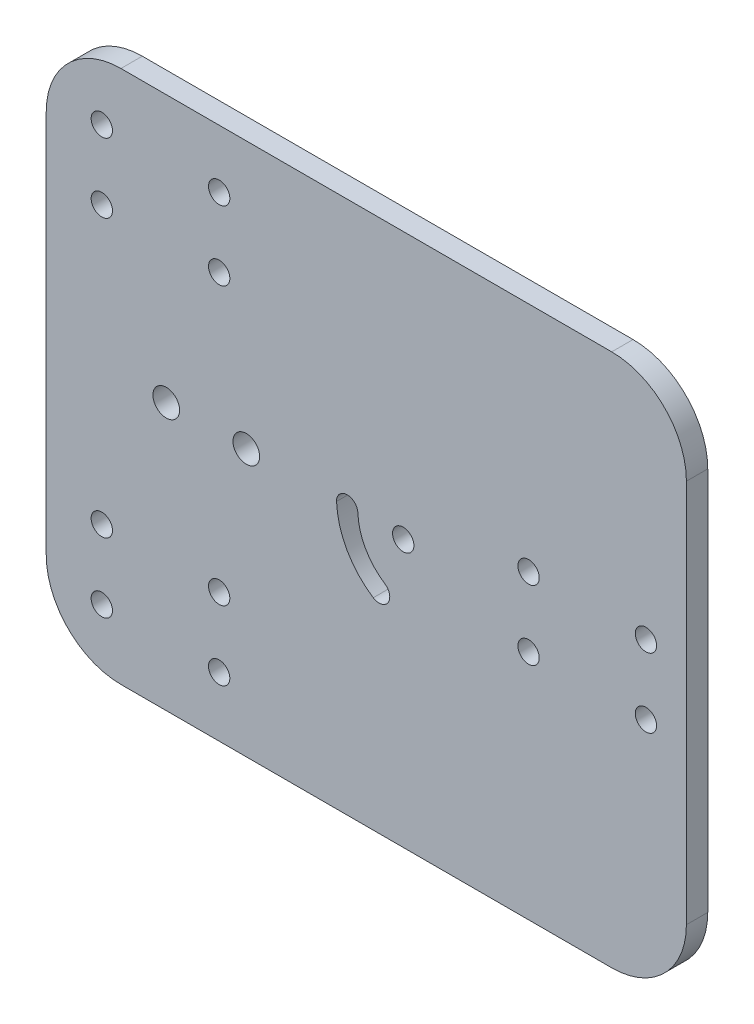
ISO-10303-21;
HEADER;
FILE_DESCRIPTION(('STEP AP214'),'2;1');
FILE_NAME('part.step','',(''),(''),'','','');
FILE_SCHEMA(('AUTOMOTIVE_DESIGN { 1 0 10303 214 1 1 1 1 }'));
ENDSEC;
DATA;
#1=APPLICATION_CONTEXT('core data for automotive mechanical design processes');
#2=APPLICATION_PROTOCOL_DEFINITION('international standard','automotive_design',2000,#1);
#3=PRODUCT_CONTEXT('',#1,'mechanical');
#4=PRODUCT('Part','Part','',(#3));
#5=PRODUCT_RELATED_PRODUCT_CATEGORY('part','',(#4));
#6=PRODUCT_DEFINITION_FORMATION('','',#4);
#7=PRODUCT_DEFINITION_CONTEXT('part definition',#1,'design');
#8=PRODUCT_DEFINITION('design','',#6,#7);
#9=PRODUCT_DEFINITION_SHAPE('','',#8);
#10=(LENGTH_UNIT() NAMED_UNIT(*) SI_UNIT(.MILLI.,.METRE.));
#11=(NAMED_UNIT(*) PLANE_ANGLE_UNIT() SI_UNIT($,.RADIAN.));
#12=(NAMED_UNIT(*) SI_UNIT($,.STERADIAN.) SOLID_ANGLE_UNIT());
#13=UNCERTAINTY_MEASURE_WITH_UNIT(LENGTH_MEASURE(1.E-05),#10,'distance_accuracy_value','');
#14=(GEOMETRIC_REPRESENTATION_CONTEXT(3) GLOBAL_UNCERTAINTY_ASSIGNED_CONTEXT((#13)) GLOBAL_UNIT_ASSIGNED_CONTEXT((#10,
#11,#12)) REPRESENTATION_CONTEXT('',''));
#15=CARTESIAN_POINT('',(0.,0.,0.));
#16=DIRECTION('',(0.,0.,1.));
#17=DIRECTION('',(1.,0.,0.));
#18=AXIS2_PLACEMENT_3D('',#15,#16,#17);
#19=CARTESIAN_POINT('',(-52.655601659751,38.8381742738589,4.));
#20=DIRECTION('',(1.,0.,0.));
#21=DIRECTION('',(0.,1.,0.));
#22=AXIS2_PLACEMENT_3D('',#19,#20,#21);
#23=PLANE('',#22);
#24=DIRECTION('',(0.,-1.,0.));
#25=VECTOR('',#24,1.);
#26=CARTESIAN_POINT('',(-52.655601659751,38.8381742738589,0.));
#27=LINE('',#26,#25);
#28=CARTESIAN_POINT('',(-52.655601659751,24.8381742738589,0.));
#29=VERTEX_POINT('',#28);
#30=CARTESIAN_POINT('',(-52.655601659751,-47.1618257261411,0.));
#31=VERTEX_POINT('',#30);
#32=EDGE_CURVE('E189',#29,#31,#27,.T.);
#33=ORIENTED_EDGE('',*,*,#32,.T.);
#34=DIRECTION('',(0.,0.,-1.));
#35=VECTOR('',#34,1.);
#36=CARTESIAN_POINT('',(-52.655601659751,-47.1618257261411,4.));
#37=LINE('',#36,#35);
#38=CARTESIAN_POINT('',(-52.655601659751,-47.1618257261411,4.));
#39=VERTEX_POINT('',#38);
#40=EDGE_CURVE('E11',#31,#39,#37,.F.);
#41=ORIENTED_EDGE('',*,*,#40,.T.);
#42=DIRECTION('',(0.,-1.,0.));
#43=VECTOR('',#42,1.);
#44=CARTESIAN_POINT('',(-52.655601659751,38.8381742738589,4.));
#45=LINE('',#44,#43);
#46=CARTESIAN_POINT('',(-52.655601659751,24.8381742738589,4.));
#47=VERTEX_POINT('',#46);
#48=EDGE_CURVE('E201',#47,#39,#45,.T.);
#49=ORIENTED_EDGE('',*,*,#48,.F.);
#50=DIRECTION('',(0.,0.,-1.));
#51=VECTOR('',#50,1.);
#52=CARTESIAN_POINT('',(-52.655601659751,24.8381742738589,4.));
#53=LINE('',#52,#51);
#54=EDGE_CURVE('E52',#47,#29,#53,.T.);
#55=ORIENTED_EDGE('',*,*,#54,.T.);
#56=EDGE_LOOP('',(#33,#41,#49,#55));
#57=FACE_BOUND('',#56,.T.);
#58=ADVANCED_FACE('F43',(#57),#23,.F.);
#59=CARTESIAN_POINT('',(-52.655601659751,-61.1618257261411,4.));
#60=DIRECTION('',(0.,1.,0.));
#61=DIRECTION('',(0.,0.,1.));
#62=AXIS2_PLACEMENT_3D('',#59,#60,#61);
#63=PLANE('',#62);
#64=DIRECTION('',(1.,0.,0.));
#65=VECTOR('',#64,1.);
#66=CARTESIAN_POINT('',(-52.655601659751,-61.1618257261411,0.));
#67=LINE('',#66,#65);
#68=CARTESIAN_POINT('',(-38.655601659751,-61.1618257261411,0.));
#69=VERTEX_POINT('',#68);
#70=CARTESIAN_POINT('',(53.3443983402489,-61.1618257261411,0.));
#71=VERTEX_POINT('',#70);
#72=EDGE_CURVE('E222',#69,#71,#67,.T.);
#73=ORIENTED_EDGE('',*,*,#72,.T.);
#74=DIRECTION('',(0.,0.,-1.));
#75=VECTOR('',#74,1.);
#76=CARTESIAN_POINT('',(53.344398340249,-61.1618257261411,4.));
#77=LINE('',#76,#75);
#78=CARTESIAN_POINT('',(53.3443983402489,-61.1618257261411,4.));
#79=VERTEX_POINT('',#78);
#80=EDGE_CURVE('E274',#71,#79,#77,.F.);
#81=ORIENTED_EDGE('',*,*,#80,.T.);
#82=DIRECTION('',(1.,0.,0.));
#83=VECTOR('',#82,1.);
#84=CARTESIAN_POINT('',(-52.655601659751,-61.1618257261411,4.));
#85=LINE('',#84,#83);
#86=CARTESIAN_POINT('',(-38.655601659751,-61.1618257261411,4.));
#87=VERTEX_POINT('',#86);
#88=EDGE_CURVE('E205',#87,#79,#85,.T.);
#89=ORIENTED_EDGE('',*,*,#88,.F.);
#90=DIRECTION('',(0.,0.,-1.));
#91=VECTOR('',#90,1.);
#92=CARTESIAN_POINT('',(-38.655601659751,-61.1618257261411,4.));
#93=LINE('',#92,#91);
#94=EDGE_CURVE('E270',#87,#69,#93,.T.);
#95=ORIENTED_EDGE('',*,*,#94,.T.);
#96=EDGE_LOOP('',(#73,#81,#89,#95));
#97=FACE_BOUND('',#96,.T.);
#98=ADVANCED_FACE('F295',(#97),#63,.F.);
#99=CARTESIAN_POINT('',(67.344398340249,38.8381742738589,4.));
#100=DIRECTION('',(-1.,0.,0.));
#101=DIRECTION('',(0.,0.,1.));
#102=AXIS2_PLACEMENT_3D('',#99,#100,#101);
#103=PLANE('',#102);
#104=DIRECTION('',(0.,1.,0.));
#105=VECTOR('',#104,1.);
#106=CARTESIAN_POINT('',(67.344398340249,38.8381742738589,0.));
#107=LINE('',#106,#105);
#108=CARTESIAN_POINT('',(67.344398340249,-47.1618257261411,0.));
#109=VERTEX_POINT('',#108);
#110=CARTESIAN_POINT('',(67.344398340249,24.8381742738589,0.));
#111=VERTEX_POINT('',#110);
#112=EDGE_CURVE('E226',#109,#111,#107,.T.);
#113=ORIENTED_EDGE('',*,*,#112,.T.);
#114=DIRECTION('',(0.,0.,-1.));
#115=VECTOR('',#114,1.);
#116=CARTESIAN_POINT('',(67.344398340249,24.8381742738589,4.));
#117=LINE('',#116,#115);
#118=CARTESIAN_POINT('',(67.344398340249,24.8381742738589,4.));
#119=VERTEX_POINT('',#118);
#120=EDGE_CURVE('E255',#111,#119,#117,.F.);
#121=ORIENTED_EDGE('',*,*,#120,.T.);
#122=DIRECTION('',(0.,1.,0.));
#123=VECTOR('',#122,1.);
#124=CARTESIAN_POINT('',(67.344398340249,38.8381742738589,4.));
#125=LINE('',#124,#123);
#126=CARTESIAN_POINT('',(67.344398340249,-47.1618257261411,4.));
#127=VERTEX_POINT('',#126);
#128=EDGE_CURVE('E210',#127,#119,#125,.T.);
#129=ORIENTED_EDGE('',*,*,#128,.F.);
#130=DIRECTION('',(0.,0.,-1.));
#131=VECTOR('',#130,1.);
#132=CARTESIAN_POINT('',(67.344398340249,-47.1618257261411,4.));
#133=LINE('',#132,#131);
#134=EDGE_CURVE('E251',#127,#109,#133,.T.);
#135=ORIENTED_EDGE('',*,*,#134,.T.);
#136=EDGE_LOOP('',(#113,#121,#129,#135));
#137=FACE_BOUND('',#136,.T.);
#138=ADVANCED_FACE('F305',(#137),#103,.F.);
#139=CARTESIAN_POINT('',(-52.655601659751,38.8381742738589,4.));
#140=DIRECTION('',(0.,-1.,0.));
#141=DIRECTION('',(0.,0.,-1.));
#142=AXIS2_PLACEMENT_3D('',#139,#140,#141);
#143=PLANE('',#142);
#144=DIRECTION('',(-1.,0.,0.));
#145=VECTOR('',#144,1.);
#146=CARTESIAN_POINT('',(-52.655601659751,38.8381742738589,4.));
#147=LINE('',#146,#145);
#148=CARTESIAN_POINT('',(53.344398340249,38.8381742738589,4.));
#149=VERTEX_POINT('',#148);
#150=CARTESIAN_POINT('',(-38.655601659751,38.8381742738589,4.));
#151=VERTEX_POINT('',#150);
#152=EDGE_CURVE('E214',#149,#151,#147,.T.);
#153=ORIENTED_EDGE('',*,*,#152,.F.);
#154=DIRECTION('',(0.,0.,-1.));
#155=VECTOR('',#154,1.);
#156=CARTESIAN_POINT('',(53.344398340249,38.8381742738589,4.));
#157=LINE('',#156,#155);
#158=CARTESIAN_POINT('',(53.344398340249,38.8381742738589,0.));
#159=VERTEX_POINT('',#158);
#160=EDGE_CURVE('E235',#149,#159,#157,.T.);
#161=ORIENTED_EDGE('',*,*,#160,.T.);
#162=DIRECTION('',(-1.,0.,0.));
#163=VECTOR('',#162,1.);
#164=CARTESIAN_POINT('',(-52.655601659751,38.8381742738589,0.));
#165=LINE('',#164,#163);
#166=CARTESIAN_POINT('',(-38.655601659751,38.8381742738589,0.));
#167=VERTEX_POINT('',#166);
#168=EDGE_CURVE('E206',#159,#167,#165,.T.);
#169=ORIENTED_EDGE('',*,*,#168,.T.);
#170=DIRECTION('',(0.,0.,-1.));
#171=VECTOR('',#170,1.);
#172=CARTESIAN_POINT('',(-38.655601659751,38.8381742738589,4.));
#173=LINE('',#172,#171);
#174=EDGE_CURVE('E218',#167,#151,#173,.F.);
#175=ORIENTED_EDGE('',*,*,#174,.T.);
#176=EDGE_LOOP('',(#153,#161,#169,#175));
#177=FACE_BOUND('',#176,.T.);
#178=ADVANCED_FACE('F313',(#177),#143,.F.);
#179=CARTESIAN_POINT('',(0.,0.,4.));
#180=DIRECTION('',(0.,0.,1.));
#181=DIRECTION('',(1.,0.,0.));
#182=AXIS2_PLACEMENT_3D('',#179,#180,#181);
#183=PLANE('',#182);
#184=CARTESIAN_POINT('',(14.2590681390147,-11.1618257261411,4.));
#185=DIRECTION('',(0.,0.,-1.));
#186=DIRECTION('',(-1.,0.,0.));
#187=AXIS2_PLACEMENT_3D('',#184,#185,#186);
#188=CIRCLE('',#187,2.);
#189=CARTESIAN_POINT('',(12.2590681390147,-11.1618257261411,4.));
#190=VERTEX_POINT('',#189);
#191=EDGE_CURVE('E641',#190,#190,#188,.T.);
#192=ORIENTED_EDGE('',*,*,#191,.T.);
#193=EDGE_LOOP('',(#192));
#194=FACE_BOUND('',#193,.T.);
#195=CARTESIAN_POINT('',(37.7590681390147,-17.6618257261411,4.));
#196=DIRECTION('',(0.,0.,-1.));
#197=DIRECTION('',(-1.,0.,0.));
#198=AXIS2_PLACEMENT_3D('',#195,#196,#197);
#199=CIRCLE('',#198,2.);
#200=CARTESIAN_POINT('',(35.7590681390147,-17.6618257261411,4.));
#201=VERTEX_POINT('',#200);
#202=EDGE_CURVE('E662',#201,#201,#199,.T.);
#203=ORIENTED_EDGE('',*,*,#202,.T.);
#204=EDGE_LOOP('',(#203));
#205=FACE_BOUND('',#204,.T.);
#206=CARTESIAN_POINT('',(59.7590681390147,-17.6618257261411,4.));
#207=DIRECTION('',(0.,0.,-1.));
#208=DIRECTION('',(-1.,0.,0.));
#209=AXIS2_PLACEMENT_3D('',#206,#207,#208);
#210=CIRCLE('',#209,2.00000000000001);
#211=CARTESIAN_POINT('',(57.7590681390147,-17.6618257261411,4.));
#212=VERTEX_POINT('',#211);
#213=EDGE_CURVE('E670',#212,#212,#210,.T.);
#214=ORIENTED_EDGE('',*,*,#213,.T.);
#215=EDGE_LOOP('',(#214));
#216=FACE_BOUND('',#215,.T.);
#217=CARTESIAN_POINT('',(59.7590681390147,-4.66182572614111,4.));
#218=DIRECTION('',(0.,0.,-1.));
#219=DIRECTION('',(-1.,0.,0.));
#220=AXIS2_PLACEMENT_3D('',#217,#218,#219);
#221=CIRCLE('',#220,2.);
#222=CARTESIAN_POINT('',(57.7590681390147,-4.66182572614111,4.));
#223=VERTEX_POINT('',#222);
#224=EDGE_CURVE('E160',#223,#223,#221,.T.);
#225=ORIENTED_EDGE('',*,*,#224,.T.);
#226=EDGE_LOOP('',(#225));
#227=FACE_BOUND('',#226,.T.);
#228=CARTESIAN_POINT('',(37.7590681390147,-4.6618257261411,4.));
#229=DIRECTION('',(0.,0.,-1.));
#230=DIRECTION('',(-1.,0.,0.));
#231=AXIS2_PLACEMENT_3D('',#228,#229,#230);
#232=CIRCLE('',#231,2.);
#233=CARTESIAN_POINT('',(35.7590681390147,-4.6618257261411,4.));
#234=VERTEX_POINT('',#233);
#235=EDGE_CURVE('E656',#234,#234,#232,.T.);
#236=ORIENTED_EDGE('',*,*,#235,.T.);
#237=EDGE_LOOP('',(#236));
#238=FACE_BOUND('',#237,.T.);
#239=CARTESIAN_POINT('',(-20.2409318609853,27.942072999651,4.));
#240=DIRECTION('',(0.,0.,-1.));
#241=DIRECTION('',(-1.,0.,0.));
#242=AXIS2_PLACEMENT_3D('',#239,#240,#241);
#243=CIRCLE('',#242,2.);
#244=CARTESIAN_POINT('',(-22.2409318609853,27.942072999651,4.));
#245=VERTEX_POINT('',#244);
#246=EDGE_CURVE('E646',#245,#245,#243,.T.);
#247=ORIENTED_EDGE('',*,*,#246,.T.);
#248=EDGE_LOOP('',(#247));
#249=FACE_BOUND('',#248,.T.);
#250=CARTESIAN_POINT('',(-20.2409318609853,14.942072999651,4.));
#251=DIRECTION('',(0.,0.,-1.));
#252=DIRECTION('',(-1.,0.,0.));
#253=AXIS2_PLACEMENT_3D('',#250,#251,#252);
#254=CIRCLE('',#253,2.);
#255=CARTESIAN_POINT('',(-22.2409318609853,14.942072999651,4.));
#256=VERTEX_POINT('',#255);
#257=EDGE_CURVE('E693',#256,#256,#254,.T.);
#258=ORIENTED_EDGE('',*,*,#257,.T.);
#259=EDGE_LOOP('',(#258));
#260=FACE_BOUND('',#259,.T.);
#261=CARTESIAN_POINT('',(-42.2409318609853,27.9420729996511,4.));
#262=DIRECTION('',(0.,0.,-1.));
#263=DIRECTION('',(-1.,0.,0.));
#264=AXIS2_PLACEMENT_3D('',#261,#262,#263);
#265=CIRCLE('',#264,2.);
#266=CARTESIAN_POINT('',(-44.2409318609853,27.9420729996511,4.));
#267=VERTEX_POINT('',#266);
#268=EDGE_CURVE('E701',#267,#267,#265,.T.);
#269=ORIENTED_EDGE('',*,*,#268,.T.);
#270=EDGE_LOOP('',(#269));
#271=FACE_BOUND('',#270,.T.);
#272=CARTESIAN_POINT('',(-42.2409318609853,14.942072999651,4.));
#273=DIRECTION('',(0.,0.,-1.));
#274=DIRECTION('',(-1.,0.,0.));
#275=AXIS2_PLACEMENT_3D('',#272,#273,#274);
#276=CIRCLE('',#275,2.);
#277=CARTESIAN_POINT('',(-44.2409318609853,14.942072999651,4.));
#278=VERTEX_POINT('',#277);
#279=EDGE_CURVE('E709',#278,#278,#276,.T.);
#280=ORIENTED_EDGE('',*,*,#279,.T.);
#281=EDGE_LOOP('',(#280));
#282=FACE_BOUND('',#281,.T.);
#283=CARTESIAN_POINT('',(-20.2409318609853,-36.9652683243143,4.));
#284=DIRECTION('',(0.,0.,-1.));
#285=DIRECTION('',(-1.,0.,0.));
#286=AXIS2_PLACEMENT_3D('',#283,#284,#285);
#287=CIRCLE('',#286,2.);
#288=CARTESIAN_POINT('',(-22.2409318609853,-36.9652683243143,4.));
#289=VERTEX_POINT('',#288);
#290=EDGE_CURVE('E717',#289,#289,#287,.T.);
#291=ORIENTED_EDGE('',*,*,#290,.T.);
#292=EDGE_LOOP('',(#291));
#293=FACE_BOUND('',#292,.T.);
#294=CARTESIAN_POINT('',(-42.2409318609853,-36.9652683243143,4.));
#295=DIRECTION('',(0.,0.,-1.));
#296=DIRECTION('',(-1.,0.,0.));
#297=AXIS2_PLACEMENT_3D('',#294,#295,#296);
#298=CIRCLE('',#297,2.);
#299=CARTESIAN_POINT('',(-44.2409318609853,-36.9652683243143,4.));
#300=VERTEX_POINT('',#299);
#301=EDGE_CURVE('E725',#300,#300,#298,.T.);
#302=ORIENTED_EDGE('',*,*,#301,.T.);
#303=EDGE_LOOP('',(#302));
#304=FACE_BOUND('',#303,.T.);
#305=CARTESIAN_POINT('',(-20.2409318609853,-49.9652683243143,4.));
#306=DIRECTION('',(0.,0.,-1.));
#307=DIRECTION('',(-1.,0.,0.));
#308=AXIS2_PLACEMENT_3D('',#305,#306,#307);
#309=CIRCLE('',#308,2.);
#310=CARTESIAN_POINT('',(-22.2409318609853,-49.9652683243143,4.));
#311=VERTEX_POINT('',#310);
#312=EDGE_CURVE('E733',#311,#311,#309,.T.);
#313=ORIENTED_EDGE('',*,*,#312,.T.);
#314=EDGE_LOOP('',(#313));
#315=FACE_BOUND('',#314,.T.);
#316=CARTESIAN_POINT('',(-42.2409318609853,-49.9652683243143,4.));
#317=DIRECTION('',(0.,0.,-1.));
#318=DIRECTION('',(-1.,0.,0.));
#319=AXIS2_PLACEMENT_3D('',#316,#317,#318);
#320=CIRCLE('',#319,2.);
#321=CARTESIAN_POINT('',(-44.2409318609853,-49.9652683243143,4.));
#322=VERTEX_POINT('',#321);
#323=EDGE_CURVE('E741',#322,#322,#320,.T.);
#324=ORIENTED_EDGE('',*,*,#323,.T.);
#325=EDGE_LOOP('',(#324));
#326=FACE_BOUND('',#325,.T.);
#327=CARTESIAN_POINT('',(17.0126483654714,-10.6667005713592,4.));
#328=DIRECTION('',(0.,0.,-1.));
#329=DIRECTION('',(-1.,0.,0.));
#330=AXIS2_PLACEMENT_3D('',#327,#328,#329);
#331=CIRCLE('',#330,15.262825405547);
#332=CARTESIAN_POINT('',(8.640926875167,-23.428679988714,4.));
#333=VERTEX_POINT('',#332);
#334=CARTESIAN_POINT('',(1.76046228827136,-11.2364893275446,4.));
#335=VERTEX_POINT('',#334);
#336=EDGE_CURVE('E134',#333,#335,#331,.T.);
#337=ORIENTED_EDGE('',*,*,#336,.T.);
#338=CARTESIAN_POINT('',(3.75906813901469,-11.1618257261411,4.));
#339=DIRECTION('',(0.,0.,-1.));
#340=DIRECTION('',(-1.,0.,0.));
#341=AXIS2_PLACEMENT_3D('',#338,#339,#340);
#342=CIRCLE('',#341,2.00000000000001);
#343=CARTESIAN_POINT('',(5.75767398975803,-11.0871621247376,4.));
#344=VERTEX_POINT('',#343);
#345=EDGE_CURVE('E144',#335,#344,#342,.T.);
#346=ORIENTED_EDGE('',*,*,#345,.T.);
#347=CARTESIAN_POINT('',(17.0126483654714,-10.6667005713592,4.));
#348=DIRECTION('',(0.,0.,1.));
#349=DIRECTION('',(-1.,0.,0.));
#350=AXIS2_PLACEMENT_3D('',#347,#348,#349);
#351=CIRCLE('',#350,11.262825405547);
#352=CARTESIAN_POINT('',(10.8349430596834,-20.0840883870262,4.));
#353=VERTEX_POINT('',#352);
#354=EDGE_CURVE('E59',#344,#353,#351,.T.);
#355=ORIENTED_EDGE('',*,*,#354,.T.);
#356=CARTESIAN_POINT('',(9.73793496742518,-21.7563841878701,4.));
#357=DIRECTION('',(0.,0.,-1.));
#358=DIRECTION('',(-1.,0.,0.));
#359=AXIS2_PLACEMENT_3D('',#356,#357,#358);
#360=CIRCLE('',#359,2.00000000000001);
#361=EDGE_CURVE('E141',#353,#333,#360,.T.);
#362=ORIENTED_EDGE('',*,*,#361,.T.);
#363=EDGE_LOOP('',(#337,#346,#355,#362));
#364=FACE_BOUND('',#363,.T.);
#365=CARTESIAN_POINT('',(-15.155601659751,-11.1618257261411,4.));
#366=DIRECTION('',(0.,0.,-1.));
#367=DIRECTION('',(-1.,0.,0.));
#368=AXIS2_PLACEMENT_3D('',#365,#366,#367);
#369=CIRCLE('',#368,2.5);
#370=CARTESIAN_POINT('',(-17.655601659751,-11.1618257261411,4.));
#371=VERTEX_POINT('',#370);
#372=EDGE_CURVE('E185',#371,#371,#369,.T.);
#373=ORIENTED_EDGE('',*,*,#372,.T.);
#374=EDGE_LOOP('',(#373));
#375=FACE_BOUND('',#374,.T.);
#376=CARTESIAN_POINT('',(-30.155601659751,-11.1618257261411,4.));
#377=DIRECTION('',(0.,0.,-1.));
#378=DIRECTION('',(-1.,0.,0.));
#379=AXIS2_PLACEMENT_3D('',#376,#377,#378);
#380=CIRCLE('',#379,2.5);
#381=CARTESIAN_POINT('',(-32.655601659751,-11.1618257261411,4.));
#382=VERTEX_POINT('',#381);
#383=EDGE_CURVE('E179',#382,#382,#380,.T.);
#384=ORIENTED_EDGE('',*,*,#383,.T.);
#385=EDGE_LOOP('',(#384));
#386=FACE_BOUND('',#385,.T.);
#387=ORIENTED_EDGE('',*,*,#128,.T.);
#388=CARTESIAN_POINT('',(53.344398340249,24.8381742738589,4.));
#389=DIRECTION('',(0.,0.,1.));
#390=DIRECTION('',(1.,0.,0.));
#391=AXIS2_PLACEMENT_3D('',#388,#389,#390);
#392=CIRCLE('',#391,14.);
#393=EDGE_CURVE('E267',#119,#149,#392,.T.);
#394=ORIENTED_EDGE('',*,*,#393,.T.);
#395=ORIENTED_EDGE('',*,*,#152,.T.);
#396=CARTESIAN_POINT('',(-38.655601659751,24.8381742738589,4.));
#397=DIRECTION('',(0.,0.,1.));
#398=DIRECTION('',(1.,0.,0.));
#399=AXIS2_PLACEMENT_3D('',#396,#397,#398);
#400=CIRCLE('',#399,14.);
#401=EDGE_CURVE('E258',#151,#47,#400,.T.);
#402=ORIENTED_EDGE('',*,*,#401,.T.);
#403=ORIENTED_EDGE('',*,*,#48,.T.);
#404=CARTESIAN_POINT('',(-38.655601659751,-47.1618257261411,4.));
#405=DIRECTION('',(0.,0.,1.));
#406=DIRECTION('',(1.,0.,0.));
#407=AXIS2_PLACEMENT_3D('',#404,#405,#406);
#408=CIRCLE('',#407,14.);
#409=EDGE_CURVE('E261',#39,#87,#408,.T.);
#410=ORIENTED_EDGE('',*,*,#409,.T.);
#411=ORIENTED_EDGE('',*,*,#88,.T.);
#412=CARTESIAN_POINT('',(53.344398340249,-47.1618257261411,4.));
#413=DIRECTION('',(0.,0.,1.));
#414=DIRECTION('',(1.,0.,0.));
#415=AXIS2_PLACEMENT_3D('',#412,#413,#414);
#416=CIRCLE('',#415,14.);
#417=EDGE_CURVE('E264',#79,#127,#416,.T.);
#418=ORIENTED_EDGE('',*,*,#417,.T.);
#419=EDGE_LOOP('',(#387,#394,#395,#402,#403,#410,#411,#418));
#420=FACE_BOUND('',#419,.T.);
#421=ADVANCED_FACE('F149',(#194,#205,#216,#227,#238,#249,#260,#271,#282,#293,#304,#315,#326,
#364,#375,#386,#420),#183,.T.);
#422=CARTESIAN_POINT('',(0.,0.,0.));
#423=DIRECTION('',(0.,0.,1.));
#424=DIRECTION('',(1.,0.,0.));
#425=AXIS2_PLACEMENT_3D('',#422,#423,#424);
#426=PLANE('',#425);
#427=CARTESIAN_POINT('',(14.2590681390147,-11.1618257261411,0.));
#428=DIRECTION('',(0.,0.,-1.));
#429=DIRECTION('',(-1.,0.,0.));
#430=AXIS2_PLACEMENT_3D('',#427,#428,#429);
#431=CIRCLE('',#430,2.);
#432=CARTESIAN_POINT('',(12.2590681390147,-11.1618257261411,0.));
#433=VERTEX_POINT('',#432);
#434=EDGE_CURVE('E644',#433,#433,#431,.T.);
#435=ORIENTED_EDGE('',*,*,#434,.F.);
#436=EDGE_LOOP('',(#435));
#437=FACE_BOUND('',#436,.T.);
#438=CARTESIAN_POINT('',(37.7590681390147,-17.6618257261411,0.));
#439=DIRECTION('',(0.,0.,-1.));
#440=DIRECTION('',(-1.,0.,0.));
#441=AXIS2_PLACEMENT_3D('',#438,#439,#440);
#442=CIRCLE('',#441,2.);
#443=CARTESIAN_POINT('',(35.7590681390147,-17.6618257261411,0.));
#444=VERTEX_POINT('',#443);
#445=EDGE_CURVE('E653',#444,#444,#442,.T.);
#446=ORIENTED_EDGE('',*,*,#445,.F.);
#447=EDGE_LOOP('',(#446));
#448=FACE_BOUND('',#447,.T.);
#449=CARTESIAN_POINT('',(59.7590681390147,-17.6618257261411,0.));
#450=DIRECTION('',(0.,0.,-1.));
#451=DIRECTION('',(-1.,0.,0.));
#452=AXIS2_PLACEMENT_3D('',#449,#450,#451);
#453=CIRCLE('',#452,2.00000000000001);
#454=CARTESIAN_POINT('',(57.7590681390147,-17.6618257261411,0.));
#455=VERTEX_POINT('',#454);
#456=EDGE_CURVE('E666',#455,#455,#453,.T.);
#457=ORIENTED_EDGE('',*,*,#456,.F.);
#458=EDGE_LOOP('',(#457));
#459=FACE_BOUND('',#458,.T.);
#460=CARTESIAN_POINT('',(59.7590681390147,-4.66182572614111,0.));
#461=DIRECTION('',(0.,0.,-1.));
#462=DIRECTION('',(-1.,0.,0.));
#463=AXIS2_PLACEMENT_3D('',#460,#461,#462);
#464=CIRCLE('',#463,2.);
#465=CARTESIAN_POINT('',(57.7590681390147,-4.66182572614111,0.));
#466=VERTEX_POINT('',#465);
#467=EDGE_CURVE('E673',#466,#466,#464,.T.);
#468=ORIENTED_EDGE('',*,*,#467,.F.);
#469=EDGE_LOOP('',(#468));
#470=FACE_BOUND('',#469,.T.);
#471=CARTESIAN_POINT('',(37.7590681390147,-4.6618257261411,0.));
#472=DIRECTION('',(0.,0.,-1.));
#473=DIRECTION('',(-1.,0.,0.));
#474=AXIS2_PLACEMENT_3D('',#471,#472,#473);
#475=CIRCLE('',#474,2.);
#476=CARTESIAN_POINT('',(35.7590681390147,-4.6618257261411,0.));
#477=VERTEX_POINT('',#476);
#478=EDGE_CURVE('E680',#477,#477,#475,.T.);
#479=ORIENTED_EDGE('',*,*,#478,.F.);
#480=EDGE_LOOP('',(#479));
#481=FACE_BOUND('',#480,.T.);
#482=CARTESIAN_POINT('',(-20.2409318609853,27.942072999651,0.));
#483=DIRECTION('',(0.,0.,-1.));
#484=DIRECTION('',(-1.,0.,0.));
#485=AXIS2_PLACEMENT_3D('',#482,#483,#484);
#486=CIRCLE('',#485,2.);
#487=CARTESIAN_POINT('',(-22.2409318609853,27.942072999651,0.));
#488=VERTEX_POINT('',#487);
#489=EDGE_CURVE('E651',#488,#488,#486,.T.);
#490=ORIENTED_EDGE('',*,*,#489,.F.);
#491=EDGE_LOOP('',(#490));
#492=FACE_BOUND('',#491,.T.);
#493=CARTESIAN_POINT('',(-20.2409318609853,14.942072999651,0.));
#494=DIRECTION('',(0.,0.,-1.));
#495=DIRECTION('',(-1.,0.,0.));
#496=AXIS2_PLACEMENT_3D('',#493,#494,#495);
#497=CIRCLE('',#496,2.);
#498=CARTESIAN_POINT('',(-22.2409318609853,14.942072999651,0.));
#499=VERTEX_POINT('',#498);
#500=EDGE_CURVE('E697',#499,#499,#497,.T.);
#501=ORIENTED_EDGE('',*,*,#500,.F.);
#502=EDGE_LOOP('',(#501));
#503=FACE_BOUND('',#502,.T.);
#504=CARTESIAN_POINT('',(-42.2409318609853,27.9420729996511,0.));
#505=DIRECTION('',(0.,0.,-1.));
#506=DIRECTION('',(-1.,0.,0.));
#507=AXIS2_PLACEMENT_3D('',#504,#505,#506);
#508=CIRCLE('',#507,2.);
#509=CARTESIAN_POINT('',(-44.2409318609853,27.9420729996511,0.));
#510=VERTEX_POINT('',#509);
#511=EDGE_CURVE('E705',#510,#510,#508,.T.);
#512=ORIENTED_EDGE('',*,*,#511,.F.);
#513=EDGE_LOOP('',(#512));
#514=FACE_BOUND('',#513,.T.);
#515=CARTESIAN_POINT('',(-42.2409318609853,14.942072999651,0.));
#516=DIRECTION('',(0.,0.,-1.));
#517=DIRECTION('',(-1.,0.,0.));
#518=AXIS2_PLACEMENT_3D('',#515,#516,#517);
#519=CIRCLE('',#518,2.);
#520=CARTESIAN_POINT('',(-44.2409318609853,14.942072999651,0.));
#521=VERTEX_POINT('',#520);
#522=EDGE_CURVE('E713',#521,#521,#519,.T.);
#523=ORIENTED_EDGE('',*,*,#522,.F.);
#524=EDGE_LOOP('',(#523));
#525=FACE_BOUND('',#524,.T.);
#526=CARTESIAN_POINT('',(-20.2409318609853,-36.9652683243143,0.));
#527=DIRECTION('',(0.,0.,-1.));
#528=DIRECTION('',(-1.,0.,0.));
#529=AXIS2_PLACEMENT_3D('',#526,#527,#528);
#530=CIRCLE('',#529,2.);
#531=CARTESIAN_POINT('',(-22.2409318609853,-36.9652683243143,0.));
#532=VERTEX_POINT('',#531);
#533=EDGE_CURVE('E721',#532,#532,#530,.T.);
#534=ORIENTED_EDGE('',*,*,#533,.F.);
#535=EDGE_LOOP('',(#534));
#536=FACE_BOUND('',#535,.T.);
#537=CARTESIAN_POINT('',(-42.2409318609853,-36.9652683243143,0.));
#538=DIRECTION('',(0.,0.,-1.));
#539=DIRECTION('',(-1.,0.,0.));
#540=AXIS2_PLACEMENT_3D('',#537,#538,#539);
#541=CIRCLE('',#540,2.);
#542=CARTESIAN_POINT('',(-44.2409318609853,-36.9652683243143,0.));
#543=VERTEX_POINT('',#542);
#544=EDGE_CURVE('E729',#543,#543,#541,.T.);
#545=ORIENTED_EDGE('',*,*,#544,.F.);
#546=EDGE_LOOP('',(#545));
#547=FACE_BOUND('',#546,.T.);
#548=CARTESIAN_POINT('',(-20.2409318609853,-49.9652683243143,0.));
#549=DIRECTION('',(0.,0.,-1.));
#550=DIRECTION('',(-1.,0.,0.));
#551=AXIS2_PLACEMENT_3D('',#548,#549,#550);
#552=CIRCLE('',#551,2.);
#553=CARTESIAN_POINT('',(-22.2409318609853,-49.9652683243143,0.));
#554=VERTEX_POINT('',#553);
#555=EDGE_CURVE('E737',#554,#554,#552,.T.);
#556=ORIENTED_EDGE('',*,*,#555,.F.);
#557=EDGE_LOOP('',(#556));
#558=FACE_BOUND('',#557,.T.);
#559=CARTESIAN_POINT('',(-42.2409318609853,-49.9652683243143,0.));
#560=DIRECTION('',(0.,0.,-1.));
#561=DIRECTION('',(-1.,0.,0.));
#562=AXIS2_PLACEMENT_3D('',#559,#560,#561);
#563=CIRCLE('',#562,2.);
#564=CARTESIAN_POINT('',(-44.2409318609853,-49.9652683243143,0.));
#565=VERTEX_POINT('',#564);
#566=EDGE_CURVE('E170',#565,#565,#563,.T.);
#567=ORIENTED_EDGE('',*,*,#566,.F.);
#568=EDGE_LOOP('',(#567));
#569=FACE_BOUND('',#568,.T.);
#570=CARTESIAN_POINT('',(3.75906813901469,-11.1618257261411,0.));
#571=DIRECTION('',(0.,0.,-1.));
#572=DIRECTION('',(-1.,0.,0.));
#573=AXIS2_PLACEMENT_3D('',#570,#571,#572);
#574=CIRCLE('',#573,2.00000000000001);
#575=CARTESIAN_POINT('',(1.76046228827136,-11.2364893275446,0.));
#576=VERTEX_POINT('',#575);
#577=CARTESIAN_POINT('',(5.75767398975803,-11.0871621247376,0.));
#578=VERTEX_POINT('',#577);
#579=EDGE_CURVE('E169',#576,#578,#574,.T.);
#580=ORIENTED_EDGE('',*,*,#579,.F.);
#581=CARTESIAN_POINT('',(17.0126483654714,-10.6667005713592,0.));
#582=DIRECTION('',(0.,0.,-1.));
#583=DIRECTION('',(-1.,0.,0.));
#584=AXIS2_PLACEMENT_3D('',#581,#582,#583);
#585=CIRCLE('',#584,15.262825405547);
#586=CARTESIAN_POINT('',(8.640926875167,-23.428679988714,0.));
#587=VERTEX_POINT('',#586);
#588=EDGE_CURVE('E67',#587,#576,#585,.T.);
#589=ORIENTED_EDGE('',*,*,#588,.F.);
#590=CARTESIAN_POINT('',(9.73793496742518,-21.7563841878701,0.));
#591=DIRECTION('',(0.,0.,-1.));
#592=DIRECTION('',(-1.,0.,0.));
#593=AXIS2_PLACEMENT_3D('',#590,#591,#592);
#594=CIRCLE('',#593,2.00000000000001);
#595=CARTESIAN_POINT('',(10.8349430596834,-20.0840883870262,0.));
#596=VERTEX_POINT('',#595);
#597=EDGE_CURVE('E153',#596,#587,#594,.T.);
#598=ORIENTED_EDGE('',*,*,#597,.F.);
#599=CARTESIAN_POINT('',(17.0126483654714,-10.6667005713592,0.));
#600=DIRECTION('',(0.,0.,1.));
#601=DIRECTION('',(-1.,0.,0.));
#602=AXIS2_PLACEMENT_3D('',#599,#600,#601);
#603=CIRCLE('',#602,11.262825405547);
#604=EDGE_CURVE('E157',#578,#596,#603,.T.);
#605=ORIENTED_EDGE('',*,*,#604,.F.);
#606=EDGE_LOOP('',(#580,#589,#598,#605));
#607=FACE_BOUND('',#606,.T.);
#608=CARTESIAN_POINT('',(-15.155601659751,-11.1618257261411,0.));
#609=DIRECTION('',(0.,0.,-1.));
#610=DIRECTION('',(-1.,0.,0.));
#611=AXIS2_PLACEMENT_3D('',#608,#609,#610);
#612=CIRCLE('',#611,2.5);
#613=CARTESIAN_POINT('',(-17.655601659751,-11.1618257261411,0.));
#614=VERTEX_POINT('',#613);
#615=EDGE_CURVE('E190',#614,#614,#612,.T.);
#616=ORIENTED_EDGE('',*,*,#615,.F.);
#617=EDGE_LOOP('',(#616));
#618=FACE_BOUND('',#617,.T.);
#619=CARTESIAN_POINT('',(-30.155601659751,-11.1618257261411,0.));
#620=DIRECTION('',(0.,0.,-1.));
#621=DIRECTION('',(-1.,0.,0.));
#622=AXIS2_PLACEMENT_3D('',#619,#620,#621);
#623=CIRCLE('',#622,2.5);
#624=CARTESIAN_POINT('',(-32.655601659751,-11.1618257261411,0.));
#625=VERTEX_POINT('',#624);
#626=EDGE_CURVE('E194',#625,#625,#623,.T.);
#627=ORIENTED_EDGE('',*,*,#626,.F.);
#628=EDGE_LOOP('',(#627));
#629=FACE_BOUND('',#628,.T.);
#630=ORIENTED_EDGE('',*,*,#168,.F.);
#631=CARTESIAN_POINT('',(53.344398340249,24.8381742738589,0.));
#632=DIRECTION('',(0.,0.,1.));
#633=DIRECTION('',(1.,0.,0.));
#634=AXIS2_PLACEMENT_3D('',#631,#632,#633);
#635=CIRCLE('',#634,14.);
#636=EDGE_CURVE('E248',#159,#111,#635,.F.);
#637=ORIENTED_EDGE('',*,*,#636,.T.);
#638=ORIENTED_EDGE('',*,*,#112,.F.);
#639=CARTESIAN_POINT('',(53.344398340249,-47.1618257261411,0.));
#640=DIRECTION('',(0.,0.,1.));
#641=DIRECTION('',(1.,0.,0.));
#642=AXIS2_PLACEMENT_3D('',#639,#640,#641);
#643=CIRCLE('',#642,14.);
#644=EDGE_CURVE('E245',#109,#71,#643,.F.);
#645=ORIENTED_EDGE('',*,*,#644,.T.);
#646=ORIENTED_EDGE('',*,*,#72,.F.);
#647=CARTESIAN_POINT('',(-38.655601659751,-47.1618257261411,0.));
#648=DIRECTION('',(0.,0.,1.));
#649=DIRECTION('',(1.,0.,0.));
#650=AXIS2_PLACEMENT_3D('',#647,#648,#649);
#651=CIRCLE('',#650,14.);
#652=EDGE_CURVE('E242',#69,#31,#651,.F.);
#653=ORIENTED_EDGE('',*,*,#652,.T.);
#654=ORIENTED_EDGE('',*,*,#32,.F.);
#655=CARTESIAN_POINT('',(-38.655601659751,24.8381742738589,0.));
#656=DIRECTION('',(0.,0.,1.));
#657=DIRECTION('',(1.,0.,0.));
#658=AXIS2_PLACEMENT_3D('',#655,#656,#657);
#659=CIRCLE('',#658,14.);
#660=EDGE_CURVE('E239',#29,#167,#659,.F.);
#661=ORIENTED_EDGE('',*,*,#660,.T.);
#662=EDGE_LOOP('',(#630,#637,#638,#645,#646,#653,#654,#661));
#663=FACE_BOUND('',#662,.T.);
#664=ADVANCED_FACE('F287',(#437,#448,#459,#470,#481,#492,#503,#514,#525,#536,#547,#558,#569,
#607,#618,#629,#663),#426,.F.);
#665=CARTESIAN_POINT('',(53.344398340249,24.8381742738589,4.));
#666=DIRECTION('',(0.,0.,-1.));
#667=DIRECTION('',(-1.,0.,0.));
#668=AXIS2_PLACEMENT_3D('',#665,#666,#667);
#669=CYLINDRICAL_SURFACE('',#668,14.);
#670=ORIENTED_EDGE('',*,*,#393,.F.);
#671=ORIENTED_EDGE('',*,*,#120,.F.);
#672=ORIENTED_EDGE('',*,*,#636,.F.);
#673=ORIENTED_EDGE('',*,*,#160,.F.);
#674=EDGE_LOOP('',(#670,#671,#672,#673));
#675=FACE_BOUND('',#674,.T.);
#676=ADVANCED_FACE('F310',(#675),#669,.T.);
#677=CARTESIAN_POINT('',(53.344398340249,-47.1618257261411,4.));
#678=DIRECTION('',(0.,0.,-1.));
#679=DIRECTION('',(-1.,0.,0.));
#680=AXIS2_PLACEMENT_3D('',#677,#678,#679);
#681=CYLINDRICAL_SURFACE('',#680,14.);
#682=ORIENTED_EDGE('',*,*,#417,.F.);
#683=ORIENTED_EDGE('',*,*,#80,.F.);
#684=ORIENTED_EDGE('',*,*,#644,.F.);
#685=ORIENTED_EDGE('',*,*,#134,.F.);
#686=EDGE_LOOP('',(#682,#683,#684,#685));
#687=FACE_BOUND('',#686,.T.);
#688=ADVANCED_FACE('F302',(#687),#681,.T.);
#689=CARTESIAN_POINT('',(-38.655601659751,-47.1618257261411,4.));
#690=DIRECTION('',(0.,0.,-1.));
#691=DIRECTION('',(-1.,0.,0.));
#692=AXIS2_PLACEMENT_3D('',#689,#690,#691);
#693=CYLINDRICAL_SURFACE('',#692,14.);
#694=ORIENTED_EDGE('',*,*,#409,.F.);
#695=ORIENTED_EDGE('',*,*,#40,.F.);
#696=ORIENTED_EDGE('',*,*,#652,.F.);
#697=ORIENTED_EDGE('',*,*,#94,.F.);
#698=EDGE_LOOP('',(#694,#695,#696,#697));
#699=FACE_BOUND('',#698,.T.);
#700=ADVANCED_FACE('F292',(#699),#693,.T.);
#701=CARTESIAN_POINT('',(-38.655601659751,24.8381742738589,4.));
#702=DIRECTION('',(0.,0.,-1.));
#703=DIRECTION('',(-1.,0.,0.));
#704=AXIS2_PLACEMENT_3D('',#701,#702,#703);
#705=CYLINDRICAL_SURFACE('',#704,14.);
#706=ORIENTED_EDGE('',*,*,#401,.F.);
#707=ORIENTED_EDGE('',*,*,#174,.F.);
#708=ORIENTED_EDGE('',*,*,#660,.F.);
#709=ORIENTED_EDGE('',*,*,#54,.F.);
#710=EDGE_LOOP('',(#706,#707,#708,#709));
#711=FACE_BOUND('',#710,.T.);
#712=ADVANCED_FACE('F45',(#711),#705,.T.);
#713=CARTESIAN_POINT('',(-30.155601659751,-11.1618257261411,4.));
#714=DIRECTION('',(0.,0.,-1.));
#715=DIRECTION('',(-1.,0.,0.));
#716=AXIS2_PLACEMENT_3D('',#713,#714,#715);
#717=CYLINDRICAL_SURFACE('',#716,2.5);
#718=ORIENTED_EDGE('',*,*,#383,.F.);
#719=EDGE_LOOP('',(#718));
#720=FACE_BOUND('',#719,.T.);
#721=ORIENTED_EDGE('',*,*,#626,.T.);
#722=EDGE_LOOP('',(#721));
#723=FACE_BOUND('',#722,.T.);
#724=ADVANCED_FACE('F316',(#720,#723),#717,.F.);
#725=CARTESIAN_POINT('',(-15.155601659751,-11.1618257261411,4.));
#726=DIRECTION('',(0.,0.,-1.));
#727=DIRECTION('',(-1.,0.,0.));
#728=AXIS2_PLACEMENT_3D('',#725,#726,#727);
#729=CYLINDRICAL_SURFACE('',#728,2.5);
#730=ORIENTED_EDGE('',*,*,#372,.F.);
#731=EDGE_LOOP('',(#730));
#732=FACE_BOUND('',#731,.T.);
#733=ORIENTED_EDGE('',*,*,#615,.T.);
#734=EDGE_LOOP('',(#733));
#735=FACE_BOUND('',#734,.T.);
#736=ADVANCED_FACE('F321',(#732,#735),#729,.F.);
#737=CARTESIAN_POINT('',(17.0126483654714,-10.6667005713592,4.));
#738=DIRECTION('',(0.,0.,-1.));
#739=DIRECTION('',(-1.,0.,0.));
#740=AXIS2_PLACEMENT_3D('',#737,#738,#739);
#741=CYLINDRICAL_SURFACE('',#740,15.262825405547);
#742=ORIENTED_EDGE('',*,*,#588,.T.);
#743=DIRECTION('',(0.,0.,-1.));
#744=VECTOR('',#743,1.);
#745=CARTESIAN_POINT('',(1.76046228827136,-11.2364893275446,4.));
#746=LINE('',#745,#744);
#747=EDGE_CURVE('E130',#335,#576,#746,.T.);
#748=ORIENTED_EDGE('',*,*,#747,.F.);
#749=ORIENTED_EDGE('',*,*,#336,.F.);
#750=DIRECTION('',(0.,0.,-1.));
#751=VECTOR('',#750,1.);
#752=CARTESIAN_POINT('',(8.640926875167,-23.428679988714,4.));
#753=LINE('',#752,#751);
#754=EDGE_CURVE('E176',#333,#587,#753,.T.);
#755=ORIENTED_EDGE('',*,*,#754,.T.);
#756=EDGE_LOOP('',(#742,#748,#749,#755));
#757=FACE_BOUND('',#756,.T.);
#758=ADVANCED_FACE('F132',(#757),#741,.F.);
#759=CARTESIAN_POINT('',(9.73793496742518,-21.7563841878701,4.));
#760=DIRECTION('',(0.,0.,-1.));
#761=DIRECTION('',(-1.,0.,0.));
#762=AXIS2_PLACEMENT_3D('',#759,#760,#761);
#763=CYLINDRICAL_SURFACE('',#762,2.00000000000001);
#764=ORIENTED_EDGE('',*,*,#597,.T.);
#765=ORIENTED_EDGE('',*,*,#754,.F.);
#766=ORIENTED_EDGE('',*,*,#361,.F.);
#767=DIRECTION('',(0.,0.,-1.));
#768=VECTOR('',#767,1.);
#769=CARTESIAN_POINT('',(10.8349430596834,-20.0840883870262,4.));
#770=LINE('',#769,#768);
#771=EDGE_CURVE('E180',#353,#596,#770,.T.);
#772=ORIENTED_EDGE('',*,*,#771,.T.);
#773=EDGE_LOOP('',(#764,#765,#766,#772));
#774=FACE_BOUND('',#773,.T.);
#775=ADVANCED_FACE('F398',(#774),#763,.F.);
#776=CARTESIAN_POINT('',(17.0126483654714,-10.6667005713592,4.));
#777=DIRECTION('',(0.,0.,-1.));
#778=DIRECTION('',(-1.,0.,0.));
#779=AXIS2_PLACEMENT_3D('',#776,#777,#778);
#780=CYLINDRICAL_SURFACE('',#779,11.262825405547);
#781=ORIENTED_EDGE('',*,*,#604,.T.);
#782=ORIENTED_EDGE('',*,*,#771,.F.);
#783=ORIENTED_EDGE('',*,*,#354,.F.);
#784=DIRECTION('',(0.,0.,-1.));
#785=VECTOR('',#784,1.);
#786=CARTESIAN_POINT('',(5.75767398975803,-11.0871621247376,4.));
#787=LINE('',#786,#785);
#788=EDGE_CURVE('E140',#344,#578,#787,.T.);
#789=ORIENTED_EDGE('',*,*,#788,.T.);
#790=EDGE_LOOP('',(#781,#782,#783,#789));
#791=FACE_BOUND('',#790,.T.);
#792=ADVANCED_FACE('F408',(#791),#780,.T.);
#793=CARTESIAN_POINT('',(3.75906813901469,-11.1618257261411,4.));
#794=DIRECTION('',(0.,0.,-1.));
#795=DIRECTION('',(-1.,0.,0.));
#796=AXIS2_PLACEMENT_3D('',#793,#794,#795);
#797=CYLINDRICAL_SURFACE('',#796,2.00000000000001);
#798=ORIENTED_EDGE('',*,*,#579,.T.);
#799=ORIENTED_EDGE('',*,*,#788,.F.);
#800=ORIENTED_EDGE('',*,*,#345,.F.);
#801=ORIENTED_EDGE('',*,*,#747,.T.);
#802=EDGE_LOOP('',(#798,#799,#800,#801));
#803=FACE_BOUND('',#802,.T.);
#804=ADVANCED_FACE('F145',(#803),#797,.F.);
#805=CARTESIAN_POINT('',(-42.2409318609853,-49.9652683243143,4.));
#806=DIRECTION('',(0.,0.,-1.));
#807=DIRECTION('',(-1.,0.,0.));
#808=AXIS2_PLACEMENT_3D('',#805,#806,#807);
#809=CYLINDRICAL_SURFACE('',#808,2.);
#810=ORIENTED_EDGE('',*,*,#323,.F.);
#811=EDGE_LOOP('',(#810));
#812=FACE_BOUND('',#811,.T.);
#813=ORIENTED_EDGE('',*,*,#566,.T.);
#814=EDGE_LOOP('',(#813));
#815=FACE_BOUND('',#814,.T.);
#816=ADVANCED_FACE('F428',(#812,#815),#809,.F.);
#817=CARTESIAN_POINT('',(-20.2409318609853,-49.9652683243143,4.));
#818=DIRECTION('',(0.,0.,-1.));
#819=DIRECTION('',(-1.,0.,0.));
#820=AXIS2_PLACEMENT_3D('',#817,#818,#819);
#821=CYLINDRICAL_SURFACE('',#820,2.);
#822=ORIENTED_EDGE('',*,*,#312,.F.);
#823=EDGE_LOOP('',(#822));
#824=FACE_BOUND('',#823,.T.);
#825=ORIENTED_EDGE('',*,*,#555,.T.);
#826=EDGE_LOOP('',(#825));
#827=FACE_BOUND('',#826,.T.);
#828=ADVANCED_FACE('F438',(#824,#827),#821,.F.);
#829=CARTESIAN_POINT('',(-42.2409318609853,-36.9652683243143,4.));
#830=DIRECTION('',(0.,0.,-1.));
#831=DIRECTION('',(-1.,0.,0.));
#832=AXIS2_PLACEMENT_3D('',#829,#830,#831);
#833=CYLINDRICAL_SURFACE('',#832,2.);
#834=ORIENTED_EDGE('',*,*,#301,.F.);
#835=EDGE_LOOP('',(#834));
#836=FACE_BOUND('',#835,.T.);
#837=ORIENTED_EDGE('',*,*,#544,.T.);
#838=EDGE_LOOP('',(#837));
#839=FACE_BOUND('',#838,.T.);
#840=ADVANCED_FACE('F449',(#836,#839),#833,.F.);
#841=CARTESIAN_POINT('',(-20.2409318609853,-36.9652683243143,4.));
#842=DIRECTION('',(0.,0.,-1.));
#843=DIRECTION('',(-1.,0.,0.));
#844=AXIS2_PLACEMENT_3D('',#841,#842,#843);
#845=CYLINDRICAL_SURFACE('',#844,2.);
#846=ORIENTED_EDGE('',*,*,#290,.F.);
#847=EDGE_LOOP('',(#846));
#848=FACE_BOUND('',#847,.T.);
#849=ORIENTED_EDGE('',*,*,#533,.T.);
#850=EDGE_LOOP('',(#849));
#851=FACE_BOUND('',#850,.T.);
#852=ADVANCED_FACE('F460',(#848,#851),#845,.F.);
#853=CARTESIAN_POINT('',(-42.2409318609853,14.942072999651,4.));
#854=DIRECTION('',(0.,0.,-1.));
#855=DIRECTION('',(-1.,0.,0.));
#856=AXIS2_PLACEMENT_3D('',#853,#854,#855);
#857=CYLINDRICAL_SURFACE('',#856,2.);
#858=ORIENTED_EDGE('',*,*,#279,.F.);
#859=EDGE_LOOP('',(#858));
#860=FACE_BOUND('',#859,.T.);
#861=ORIENTED_EDGE('',*,*,#522,.T.);
#862=EDGE_LOOP('',(#861));
#863=FACE_BOUND('',#862,.T.);
#864=ADVANCED_FACE('F471',(#860,#863),#857,.F.);
#865=CARTESIAN_POINT('',(-42.2409318609853,27.9420729996511,4.));
#866=DIRECTION('',(0.,0.,-1.));
#867=DIRECTION('',(-1.,0.,0.));
#868=AXIS2_PLACEMENT_3D('',#865,#866,#867);
#869=CYLINDRICAL_SURFACE('',#868,2.);
#870=ORIENTED_EDGE('',*,*,#268,.F.);
#871=EDGE_LOOP('',(#870));
#872=FACE_BOUND('',#871,.T.);
#873=ORIENTED_EDGE('',*,*,#511,.T.);
#874=EDGE_LOOP('',(#873));
#875=FACE_BOUND('',#874,.T.);
#876=ADVANCED_FACE('F482',(#872,#875),#869,.F.);
#877=CARTESIAN_POINT('',(-20.2409318609853,14.942072999651,4.));
#878=DIRECTION('',(0.,0.,-1.));
#879=DIRECTION('',(-1.,0.,0.));
#880=AXIS2_PLACEMENT_3D('',#877,#878,#879);
#881=CYLINDRICAL_SURFACE('',#880,2.);
#882=ORIENTED_EDGE('',*,*,#257,.F.);
#883=EDGE_LOOP('',(#882));
#884=FACE_BOUND('',#883,.T.);
#885=ORIENTED_EDGE('',*,*,#500,.T.);
#886=EDGE_LOOP('',(#885));
#887=FACE_BOUND('',#886,.T.);
#888=ADVANCED_FACE('F493',(#884,#887),#881,.F.);
#889=CARTESIAN_POINT('',(-20.2409318609853,27.942072999651,4.));
#890=DIRECTION('',(0.,0.,-1.));
#891=DIRECTION('',(-1.,0.,0.));
#892=AXIS2_PLACEMENT_3D('',#889,#890,#891);
#893=CYLINDRICAL_SURFACE('',#892,2.);
#894=ORIENTED_EDGE('',*,*,#246,.F.);
#895=EDGE_LOOP('',(#894));
#896=FACE_BOUND('',#895,.T.);
#897=ORIENTED_EDGE('',*,*,#489,.T.);
#898=EDGE_LOOP('',(#897));
#899=FACE_BOUND('',#898,.T.);
#900=ADVANCED_FACE('F504',(#896,#899),#893,.F.);
#901=CARTESIAN_POINT('',(37.7590681390147,-4.6618257261411,4.));
#902=DIRECTION('',(0.,0.,-1.));
#903=DIRECTION('',(-1.,0.,0.));
#904=AXIS2_PLACEMENT_3D('',#901,#902,#903);
#905=CYLINDRICAL_SURFACE('',#904,2.);
#906=ORIENTED_EDGE('',*,*,#235,.F.);
#907=EDGE_LOOP('',(#906));
#908=FACE_BOUND('',#907,.T.);
#909=ORIENTED_EDGE('',*,*,#478,.T.);
#910=EDGE_LOOP('',(#909));
#911=FACE_BOUND('',#910,.T.);
#912=ADVANCED_FACE('F515',(#908,#911),#905,.F.);
#913=CARTESIAN_POINT('',(59.7590681390147,-4.66182572614111,4.));
#914=DIRECTION('',(0.,0.,-1.));
#915=DIRECTION('',(-1.,0.,0.));
#916=AXIS2_PLACEMENT_3D('',#913,#914,#915);
#917=CYLINDRICAL_SURFACE('',#916,2.);
#918=ORIENTED_EDGE('',*,*,#224,.F.);
#919=EDGE_LOOP('',(#918));
#920=FACE_BOUND('',#919,.T.);
#921=ORIENTED_EDGE('',*,*,#467,.T.);
#922=EDGE_LOOP('',(#921));
#923=FACE_BOUND('',#922,.T.);
#924=ADVANCED_FACE('F526',(#920,#923),#917,.F.);
#925=CARTESIAN_POINT('',(59.7590681390147,-17.6618257261411,4.));
#926=DIRECTION('',(0.,0.,-1.));
#927=DIRECTION('',(-1.,0.,0.));
#928=AXIS2_PLACEMENT_3D('',#925,#926,#927);
#929=CYLINDRICAL_SURFACE('',#928,2.00000000000001);
#930=ORIENTED_EDGE('',*,*,#213,.F.);
#931=EDGE_LOOP('',(#930));
#932=FACE_BOUND('',#931,.T.);
#933=ORIENTED_EDGE('',*,*,#456,.T.);
#934=EDGE_LOOP('',(#933));
#935=FACE_BOUND('',#934,.T.);
#936=ADVANCED_FACE('F537',(#932,#935),#929,.F.);
#937=CARTESIAN_POINT('',(37.7590681390147,-17.6618257261411,4.));
#938=DIRECTION('',(0.,0.,-1.));
#939=DIRECTION('',(-1.,0.,0.));
#940=AXIS2_PLACEMENT_3D('',#937,#938,#939);
#941=CYLINDRICAL_SURFACE('',#940,2.);
#942=ORIENTED_EDGE('',*,*,#202,.F.);
#943=EDGE_LOOP('',(#942));
#944=FACE_BOUND('',#943,.T.);
#945=ORIENTED_EDGE('',*,*,#445,.T.);
#946=EDGE_LOOP('',(#945));
#947=FACE_BOUND('',#946,.T.);
#948=ADVANCED_FACE('F548',(#944,#947),#941,.F.);
#949=CARTESIAN_POINT('',(14.2590681390147,-11.1618257261411,4.));
#950=DIRECTION('',(0.,0.,-1.));
#951=DIRECTION('',(-1.,0.,0.));
#952=AXIS2_PLACEMENT_3D('',#949,#950,#951);
#953=CYLINDRICAL_SURFACE('',#952,2.);
#954=ORIENTED_EDGE('',*,*,#191,.F.);
#955=EDGE_LOOP('',(#954));
#956=FACE_BOUND('',#955,.T.);
#957=ORIENTED_EDGE('',*,*,#434,.T.);
#958=EDGE_LOOP('',(#957));
#959=FACE_BOUND('',#958,.T.);
#960=ADVANCED_FACE('F559',(#956,#959),#953,.F.);
#961=CLOSED_SHELL('',(#58,#98,#138,#178,#421,#664,#676,#688,#700,#712,#724,#736,#758,#775,#792,
#804,#816,#828,#840,#852,#864,#876,#888,#900,#912,#924,#936,#948,#960));
#962=MANIFOLD_SOLID_BREP('B2',#961);
#963=ADVANCED_BREP_SHAPE_REPRESENTATION('',(#18,#962),#14);
#964=SHAPE_DEFINITION_REPRESENTATION(#9,#963);
ENDSEC;
END-ISO-10303-21;
